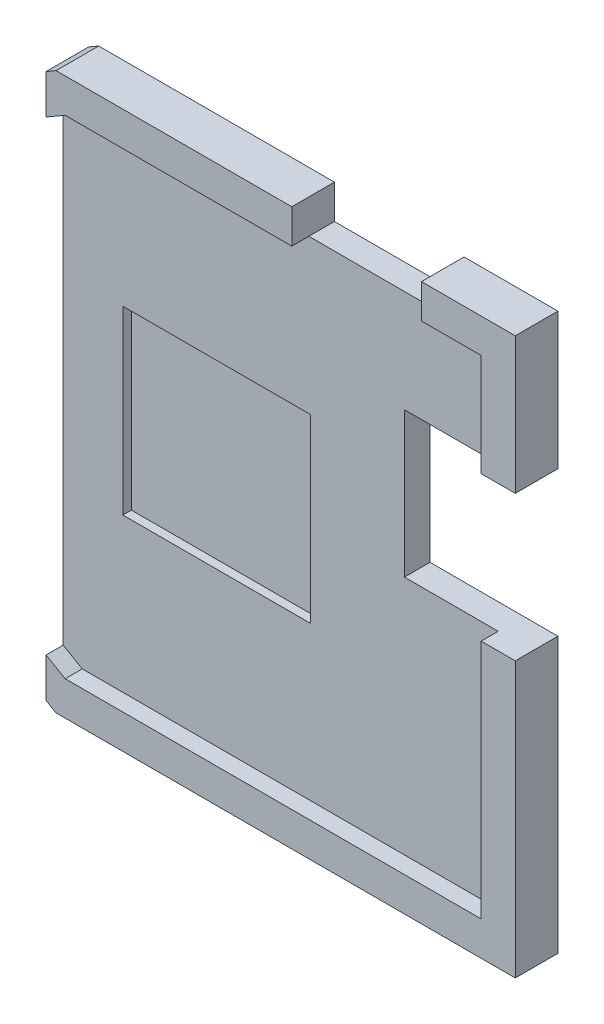
ISO-10303-21;
HEADER;
FILE_DESCRIPTION(('STEP AP214'),'2;1');
FILE_NAME('part.step','',(''),(''),'','','');
FILE_SCHEMA(('AUTOMOTIVE_DESIGN { 1 0 10303 214 1 1 1 1 }'));
ENDSEC;
DATA;
#1=APPLICATION_CONTEXT('core data for automotive mechanical design processes');
#2=APPLICATION_PROTOCOL_DEFINITION('international standard','automotive_design',2000,#1);
#3=PRODUCT_CONTEXT('',#1,'mechanical');
#4=PRODUCT('Part','Part','',(#3));
#5=PRODUCT_RELATED_PRODUCT_CATEGORY('part','',(#4));
#6=PRODUCT_DEFINITION_FORMATION('','',#4);
#7=PRODUCT_DEFINITION_CONTEXT('part definition',#1,'design');
#8=PRODUCT_DEFINITION('design','',#6,#7);
#9=PRODUCT_DEFINITION_SHAPE('','',#8);
#10=(LENGTH_UNIT() NAMED_UNIT(*) SI_UNIT(.MILLI.,.METRE.));
#11=(NAMED_UNIT(*) PLANE_ANGLE_UNIT() SI_UNIT($,.RADIAN.));
#12=(NAMED_UNIT(*) SI_UNIT($,.STERADIAN.) SOLID_ANGLE_UNIT());
#13=UNCERTAINTY_MEASURE_WITH_UNIT(LENGTH_MEASURE(1.E-05),#10,'distance_accuracy_value','');
#14=(GEOMETRIC_REPRESENTATION_CONTEXT(3) GLOBAL_UNCERTAINTY_ASSIGNED_CONTEXT((#13)) GLOBAL_UNIT_ASSIGNED_CONTEXT((#10,
#11,#12)) REPRESENTATION_CONTEXT('',''));
#15=CARTESIAN_POINT('',(0.,0.,0.));
#16=DIRECTION('',(0.,0.,1.));
#17=DIRECTION('',(1.,0.,0.));
#18=AXIS2_PLACEMENT_3D('',#15,#16,#17);
#19=CARTESIAN_POINT('',(30.25,31.4,-8.));
#20=DIRECTION('',(-1.,0.,0.));
#21=DIRECTION('',(0.,0.,1.));
#22=AXIS2_PLACEMENT_3D('',#19,#20,#21);
#23=PLANE('',#22);
#24=DIRECTION('',(0.,1.,0.));
#25=VECTOR('',#24,1.);
#26=CARTESIAN_POINT('',(30.25,0.,16.5));
#27=LINE('',#26,#25);
#28=CARTESIAN_POINT('',(30.25,-15.9637349430953,16.5));
#29=VERTEX_POINT('',#28);
#30=CARTESIAN_POINT('',(30.25,15.9637349430924,16.5));
#31=VERTEX_POINT('',#30);
#32=EDGE_CURVE('E366',#29,#31,#27,.T.);
#33=ORIENTED_EDGE('',*,*,#32,.F.);
#34=DIRECTION('',(0.,0.,1.));
#35=VECTOR('',#34,1.);
#36=CARTESIAN_POINT('',(30.25,-15.9637349430953,16.5));
#37=LINE('',#36,#35);
#38=CARTESIAN_POINT('',(30.25,-15.9637349430953,19.));
#39=VERTEX_POINT('',#38);
#40=EDGE_CURVE('E236',#29,#39,#37,.T.);
#41=ORIENTED_EDGE('',*,*,#40,.T.);
#42=DIRECTION('',(0.,1.,0.));
#43=VECTOR('',#42,1.);
#44=CARTESIAN_POINT('',(30.25,0.,19.));
#45=LINE('',#44,#43);
#46=CARTESIAN_POINT('',(30.25,-13.6543338663368,19.));
#47=VERTEX_POINT('',#46);
#48=EDGE_CURVE('E231',#39,#47,#45,.T.);
#49=ORIENTED_EDGE('',*,*,#48,.T.);
#50=DIRECTION('',(0.,0.,1.));
#51=VECTOR('',#50,1.);
#52=CARTESIAN_POINT('',(30.25,-13.6543338663368,16.5));
#53=LINE('',#52,#51);
#54=CARTESIAN_POINT('',(30.25,-13.6543338663368,18.));
#55=VERTEX_POINT('',#54);
#56=EDGE_CURVE('E230',#55,#47,#53,.T.);
#57=ORIENTED_EDGE('',*,*,#56,.F.);
#58=DIRECTION('',(0.,1.,0.));
#59=VECTOR('',#58,1.);
#60=CARTESIAN_POINT('',(30.25,0.,18.));
#61=LINE('',#60,#59);
#62=CARTESIAN_POINT('',(30.25,13.6543338663339,18.));
#63=VERTEX_POINT('',#62);
#64=EDGE_CURVE('E214',#55,#63,#61,.T.);
#65=ORIENTED_EDGE('',*,*,#64,.T.);
#66=DIRECTION('',(0.,0.,-1.));
#67=VECTOR('',#66,1.);
#68=CARTESIAN_POINT('',(30.25,13.6543338663339,16.5));
#69=LINE('',#68,#67);
#70=CARTESIAN_POINT('',(30.25,13.6543338663339,19.));
#71=VERTEX_POINT('',#70);
#72=EDGE_CURVE('E224',#71,#63,#69,.T.);
#73=ORIENTED_EDGE('',*,*,#72,.F.);
#74=CARTESIAN_POINT('',(30.25,15.9637349430924,19.));
#75=VERTEX_POINT('',#74);
#76=EDGE_CURVE('E371',#71,#75,#45,.T.);
#77=ORIENTED_EDGE('',*,*,#76,.T.);
#78=DIRECTION('',(0.,0.,-1.));
#79=VECTOR('',#78,1.);
#80=CARTESIAN_POINT('',(30.25,15.9637349430924,16.5));
#81=LINE('',#80,#79);
#82=EDGE_CURVE('E239',#75,#31,#81,.T.);
#83=ORIENTED_EDGE('',*,*,#82,.T.);
#84=EDGE_LOOP('',(#33,#41,#49,#57,#65,#73,#77,#83));
#85=FACE_BOUND('',#84,.T.);
#86=ADVANCED_FACE('F33',(#85),#23,.T.);
#87=CARTESIAN_POINT('',(0.,0.,19.));
#88=DIRECTION('',(0.,0.,-1.));
#89=DIRECTION('',(-1.,0.,0.));
#90=AXIS2_PLACEMENT_3D('',#87,#88,#89);
#91=PLANE('',#90);
#92=ORIENTED_EDGE('',*,*,#48,.F.);
#93=DIRECTION('',(-0.866025403784439,0.5,0.));
#94=VECTOR('',#93,1.);
#95=CARTESIAN_POINT('',(30.832428163369,-16.3,19.));
#96=LINE('',#95,#94);
#97=CARTESIAN_POINT('',(30.832428163369,-16.3,19.));
#98=VERTEX_POINT('',#97);
#99=EDGE_CURVE('E249',#98,#39,#96,.T.);
#100=ORIENTED_EDGE('',*,*,#99,.F.);
#101=DIRECTION('',(-1.,0.,0.));
#102=VECTOR('',#101,1.);
#103=CARTESIAN_POINT('',(57.75,-16.3,19.));
#104=LINE('',#103,#102);
#105=CARTESIAN_POINT('',(57.75,-16.3,19.));
#106=VERTEX_POINT('',#105);
#107=EDGE_CURVE('E252',#106,#98,#104,.T.);
#108=ORIENTED_EDGE('',*,*,#107,.F.);
#109=DIRECTION('',(0.,-1.,0.));
#110=VECTOR('',#109,1.);
#111=CARTESIAN_POINT('',(57.75,16.3,19.));
#112=LINE('',#111,#110);
#113=CARTESIAN_POINT('',(57.75,-0.200000000000002,19.));
#114=VERTEX_POINT('',#113);
#115=EDGE_CURVE('E451',#114,#106,#112,.T.);
#116=ORIENTED_EDGE('',*,*,#115,.F.);
#117=DIRECTION('',(1.,0.,0.));
#118=VECTOR('',#117,1.);
#119=CARTESIAN_POINT('',(56.95,-0.200000000000003,19.));
#120=LINE('',#119,#118);
#121=CARTESIAN_POINT('',(55.75,-0.200000000000003,19.));
#122=VERTEX_POINT('',#121);
#123=EDGE_CURVE('E363',#122,#114,#120,.T.);
#124=ORIENTED_EDGE('',*,*,#123,.F.);
#125=DIRECTION('',(0.,-1.,0.));
#126=VECTOR('',#125,1.);
#127=CARTESIAN_POINT('',(55.75,14.3,19.));
#128=LINE('',#127,#126);
#129=CARTESIAN_POINT('',(55.75,-14.3,19.));
#130=VERTEX_POINT('',#129);
#131=EDGE_CURVE('E406',#122,#130,#128,.T.);
#132=ORIENTED_EDGE('',*,*,#131,.T.);
#133=DIRECTION('',(-1.,0.,0.));
#134=VECTOR('',#133,1.);
#135=CARTESIAN_POINT('',(55.75,-14.3,19.));
#136=LINE('',#135,#134);
#137=CARTESIAN_POINT('',(31.3683265482312,-14.3,19.));
#138=VERTEX_POINT('',#137);
#139=EDGE_CURVE('E260',#130,#138,#136,.T.);
#140=ORIENTED_EDGE('',*,*,#139,.T.);
#141=DIRECTION('',(-0.866025403784439,0.5,0.));
#142=VECTOR('',#141,1.);
#143=CARTESIAN_POINT('',(31.3683265482312,-14.3,19.));
#144=LINE('',#143,#142);
#145=EDGE_CURVE('E257',#138,#47,#144,.T.);
#146=ORIENTED_EDGE('',*,*,#145,.T.);
#147=EDGE_LOOP('',(#92,#100,#108,#116,#124,#132,#140,#146));
#148=FACE_BOUND('',#147,.T.);
#149=ADVANCED_FACE('F395',(#148),#91,.F.);
#150=ORIENTED_EDGE('',*,*,#76,.F.);
#151=DIRECTION('',(0.866025403784439,0.5,0.));
#152=VECTOR('',#151,1.);
#153=CARTESIAN_POINT('',(29.25,13.0769835971443,19.));
#154=LINE('',#153,#152);
#155=CARTESIAN_POINT('',(31.3683265482362,14.3,19.));
#156=VERTEX_POINT('',#155);
#157=EDGE_CURVE('E226',#71,#156,#154,.T.);
#158=ORIENTED_EDGE('',*,*,#157,.T.);
#159=DIRECTION('',(1.,0.,0.));
#160=VECTOR('',#159,1.);
#161=CARTESIAN_POINT('',(31.3683265482362,14.3,19.));
#162=LINE('',#161,#160);
#163=CARTESIAN_POINT('',(44.65,14.3,19.));
#164=VERTEX_POINT('',#163);
#165=EDGE_CURVE('E277',#156,#164,#162,.T.);
#166=ORIENTED_EDGE('',*,*,#165,.T.);
#167=DIRECTION('',(0.,1.,0.));
#168=VECTOR('',#167,1.);
#169=CARTESIAN_POINT('',(44.65,0.,19.));
#170=LINE('',#169,#168);
#171=CARTESIAN_POINT('',(44.65,16.3,19.));
#172=VERTEX_POINT('',#171);
#173=EDGE_CURVE('E319',#164,#172,#170,.T.);
#174=ORIENTED_EDGE('',*,*,#173,.T.);
#175=DIRECTION('',(1.,0.,0.));
#176=VECTOR('',#175,1.);
#177=CARTESIAN_POINT('',(30.832428163374,16.3,19.));
#178=LINE('',#177,#176);
#179=CARTESIAN_POINT('',(30.832428163374,16.3,19.));
#180=VERTEX_POINT('',#179);
#181=EDGE_CURVE('E453',#180,#172,#178,.T.);
#182=ORIENTED_EDGE('',*,*,#181,.F.);
#183=DIRECTION('',(0.866025403784439,0.5,0.));
#184=VECTOR('',#183,1.);
#185=CARTESIAN_POINT('',(27.25,14.2316841355235,19.));
#186=LINE('',#185,#184);
#187=EDGE_CURVE('E253',#75,#180,#186,.T.);
#188=ORIENTED_EDGE('',*,*,#187,.F.);
#189=EDGE_LOOP('',(#150,#158,#166,#174,#182,#188));
#190=FACE_BOUND('',#189,.T.);
#191=ADVANCED_FACE('F484',(#190),#91,.F.);
#192=CARTESIAN_POINT('',(29.25,13.0769835971443,16.5));
#193=DIRECTION('',(0.5,-0.866025403784439,0.));
#194=DIRECTION('',(0.866025403784439,0.5,0.));
#195=AXIS2_PLACEMENT_3D('',#192,#193,#194);
#196=PLANE('',#195);
#197=ORIENTED_EDGE('',*,*,#157,.F.);
#198=ORIENTED_EDGE('',*,*,#72,.T.);
#199=DIRECTION('',(0.866025403784439,0.5,0.));
#200=VECTOR('',#199,1.);
#201=CARTESIAN_POINT('',(29.25,13.0769835971443,18.));
#202=LINE('',#201,#200);
#203=CARTESIAN_POINT('',(31.3683265482362,14.3,18.));
#204=VERTEX_POINT('',#203);
#205=EDGE_CURVE('E37',#63,#204,#202,.T.);
#206=ORIENTED_EDGE('',*,*,#205,.T.);
#207=DIRECTION('',(0.,0.,1.));
#208=VECTOR('',#207,1.);
#209=CARTESIAN_POINT('',(31.3683265482362,14.3,16.5));
#210=LINE('',#209,#208);
#211=EDGE_CURVE('E255',#204,#156,#210,.T.);
#212=ORIENTED_EDGE('',*,*,#211,.T.);
#213=EDGE_LOOP('',(#197,#198,#206,#212));
#214=FACE_BOUND('',#213,.T.);
#215=ADVANCED_FACE('F225',(#214),#196,.T.);
#216=CARTESIAN_POINT('',(31.3683265482312,-14.3,16.5));
#217=DIRECTION('',(0.5,0.866025403784438,0.));
#218=DIRECTION('',(-0.866025403784439,0.5,0.));
#219=AXIS2_PLACEMENT_3D('',#216,#217,#218);
#220=PLANE('',#219);
#221=DIRECTION('',(-0.866025403784439,0.5,0.));
#222=VECTOR('',#221,1.);
#223=CARTESIAN_POINT('',(31.3683265482312,-14.3,18.));
#224=LINE('',#223,#222);
#225=CARTESIAN_POINT('',(31.3683265482312,-14.3,18.));
#226=VERTEX_POINT('',#225);
#227=EDGE_CURVE('E262',#226,#55,#224,.T.);
#228=ORIENTED_EDGE('',*,*,#227,.T.);
#229=ORIENTED_EDGE('',*,*,#56,.T.);
#230=ORIENTED_EDGE('',*,*,#145,.F.);
#231=DIRECTION('',(0.,0.,1.));
#232=VECTOR('',#231,1.);
#233=CARTESIAN_POINT('',(31.3683265482312,-14.3,16.5));
#234=LINE('',#233,#232);
#235=EDGE_CURVE('E261',#226,#138,#234,.T.);
#236=ORIENTED_EDGE('',*,*,#235,.F.);
#237=EDGE_LOOP('',(#228,#229,#230,#236));
#238=FACE_BOUND('',#237,.T.);
#239=ADVANCED_FACE('F35',(#238),#220,.T.);
#240=CARTESIAN_POINT('',(0.,0.,16.5));
#241=DIRECTION('',(0.,0.,-1.));
#242=DIRECTION('',(-1.,0.,0.));
#243=AXIS2_PLACEMENT_3D('',#240,#241,#242);
#244=PLANE('',#243);
#245=DIRECTION('',(-0.866025403784439,0.5,0.));
#246=VECTOR('',#245,1.);
#247=CARTESIAN_POINT('',(30.832428163369,-16.3,16.5));
#248=LINE('',#247,#246);
#249=CARTESIAN_POINT('',(30.832428163369,-16.3,16.5));
#250=VERTEX_POINT('',#249);
#251=EDGE_CURVE('E243',#250,#29,#248,.T.);
#252=ORIENTED_EDGE('',*,*,#251,.T.);
#253=ORIENTED_EDGE('',*,*,#32,.T.);
#254=DIRECTION('',(0.866025403784439,0.5,0.));
#255=VECTOR('',#254,1.);
#256=CARTESIAN_POINT('',(27.25,14.2316841355235,16.5));
#257=LINE('',#256,#255);
#258=CARTESIAN_POINT('',(30.832428163374,16.3,16.5));
#259=VERTEX_POINT('',#258);
#260=EDGE_CURVE('E247',#31,#259,#257,.T.);
#261=ORIENTED_EDGE('',*,*,#260,.T.);
#262=DIRECTION('',(1.,0.,0.));
#263=VECTOR('',#262,1.);
#264=CARTESIAN_POINT('',(30.832428163374,16.3,16.5));
#265=LINE('',#264,#263);
#266=CARTESIAN_POINT('',(44.65,16.3,16.5));
#267=VERTEX_POINT('',#266);
#268=EDGE_CURVE('E462',#259,#267,#265,.T.);
#269=ORIENTED_EDGE('',*,*,#268,.T.);
#270=DIRECTION('',(0.,1.,0.));
#271=VECTOR('',#270,1.);
#272=CARTESIAN_POINT('',(44.65,14.3,16.5));
#273=LINE('',#272,#271);
#274=CARTESIAN_POINT('',(44.65,14.3,16.5));
#275=VERTEX_POINT('',#274);
#276=EDGE_CURVE('E322',#275,#267,#273,.T.);
#277=ORIENTED_EDGE('',*,*,#276,.F.);
#278=DIRECTION('',(-1.,0.,0.));
#279=VECTOR('',#278,1.);
#280=CARTESIAN_POINT('',(44.65,14.3,16.5));
#281=LINE('',#280,#279);
#282=CARTESIAN_POINT('',(52.25,14.3,16.5));
#283=VERTEX_POINT('',#282);
#284=EDGE_CURVE('E334',#283,#275,#281,.T.);
#285=ORIENTED_EDGE('',*,*,#284,.F.);
#286=DIRECTION('',(0.,1.,0.));
#287=VECTOR('',#286,1.);
#288=CARTESIAN_POINT('',(52.25,14.3,16.5));
#289=LINE('',#288,#287);
#290=CARTESIAN_POINT('',(52.25,16.3,16.5));
#291=VERTEX_POINT('',#290);
#292=EDGE_CURVE('E323',#283,#291,#289,.T.);
#293=ORIENTED_EDGE('',*,*,#292,.T.);
#294=CARTESIAN_POINT('',(57.75,16.3,16.5));
#295=VERTEX_POINT('',#294);
#296=EDGE_CURVE('E250',#291,#295,#265,.T.);
#297=ORIENTED_EDGE('',*,*,#296,.T.);
#298=DIRECTION('',(0.,-1.,0.));
#299=VECTOR('',#298,1.);
#300=CARTESIAN_POINT('',(57.75,16.3,16.5));
#301=LINE('',#300,#299);
#302=CARTESIAN_POINT('',(57.75,8.3,16.5));
#303=VERTEX_POINT('',#302);
#304=EDGE_CURVE('E442',#295,#303,#301,.T.);
#305=ORIENTED_EDGE('',*,*,#304,.T.);
#306=DIRECTION('',(1.,0.,0.));
#307=VECTOR('',#306,1.);
#308=CARTESIAN_POINT('',(56.95,8.3,16.5));
#309=LINE('',#308,#307);
#310=CARTESIAN_POINT('',(50.25,8.3,16.5));
#311=VERTEX_POINT('',#310);
#312=EDGE_CURVE('E356',#311,#303,#309,.T.);
#313=ORIENTED_EDGE('',*,*,#312,.F.);
#314=DIRECTION('',(0.,1.,0.));
#315=VECTOR('',#314,1.);
#316=CARTESIAN_POINT('',(50.25,-0.200000000000003,16.5));
#317=LINE('',#316,#315);
#318=CARTESIAN_POINT('',(50.25,-0.200000000000003,16.5));
#319=VERTEX_POINT('',#318);
#320=EDGE_CURVE('E358',#319,#311,#317,.T.);
#321=ORIENTED_EDGE('',*,*,#320,.F.);
#322=DIRECTION('',(-1.,0.,0.));
#323=VECTOR('',#322,1.);
#324=CARTESIAN_POINT('',(56.95,-0.200000000000003,16.5));
#325=LINE('',#324,#323);
#326=CARTESIAN_POINT('',(57.75,-0.200000000000002,16.5));
#327=VERTEX_POINT('',#326);
#328=EDGE_CURVE('E347',#327,#319,#325,.T.);
#329=ORIENTED_EDGE('',*,*,#328,.F.);
#330=CARTESIAN_POINT('',(57.75,-16.3,16.5));
#331=VERTEX_POINT('',#330);
#332=EDGE_CURVE('E461',#327,#331,#301,.T.);
#333=ORIENTED_EDGE('',*,*,#332,.T.);
#334=DIRECTION('',(-1.,0.,0.));
#335=VECTOR('',#334,1.);
#336=CARTESIAN_POINT('',(57.75,-16.3,16.5));
#337=LINE('',#336,#335);
#338=EDGE_CURVE('E245',#331,#250,#337,.T.);
#339=ORIENTED_EDGE('',*,*,#338,.T.);
#340=EDGE_LOOP('',(#252,#253,#261,#269,#277,#285,#293,#297,#305,#313,#321,#329,#333,#339));
#341=FACE_BOUND('',#340,.T.);
#342=ADVANCED_FACE('F383',(#341),#244,.T.);
#343=CARTESIAN_POINT('',(27.25,14.2316841355235,16.5));
#344=DIRECTION('',(0.5,-0.866025403784439,0.));
#345=DIRECTION('',(0.866025403784439,0.5,0.));
#346=AXIS2_PLACEMENT_3D('',#343,#344,#345);
#347=PLANE('',#346);
#348=ORIENTED_EDGE('',*,*,#82,.F.);
#349=ORIENTED_EDGE('',*,*,#187,.T.);
#350=DIRECTION('',(0.,0.,1.));
#351=VECTOR('',#350,1.);
#352=CARTESIAN_POINT('',(30.832428163374,16.3,16.5));
#353=LINE('',#352,#351);
#354=EDGE_CURVE('E379',#259,#180,#353,.T.);
#355=ORIENTED_EDGE('',*,*,#354,.F.);
#356=ORIENTED_EDGE('',*,*,#260,.F.);
#357=EDGE_LOOP('',(#348,#349,#355,#356));
#358=FACE_BOUND('',#357,.T.);
#359=ADVANCED_FACE('F376',(#358),#347,.F.);
#360=CARTESIAN_POINT('',(30.832428163369,-16.3,16.5));
#361=DIRECTION('',(0.5,0.866025403784439,0.));
#362=DIRECTION('',(-0.866025403784439,0.5,0.));
#363=AXIS2_PLACEMENT_3D('',#360,#361,#362);
#364=PLANE('',#363);
#365=ORIENTED_EDGE('',*,*,#40,.F.);
#366=ORIENTED_EDGE('',*,*,#251,.F.);
#367=DIRECTION('',(0.,0.,1.));
#368=VECTOR('',#367,1.);
#369=CARTESIAN_POINT('',(30.832428163369,-16.3,16.5));
#370=LINE('',#369,#368);
#371=EDGE_CURVE('E246',#250,#98,#370,.T.);
#372=ORIENTED_EDGE('',*,*,#371,.T.);
#373=ORIENTED_EDGE('',*,*,#99,.T.);
#374=EDGE_LOOP('',(#365,#366,#372,#373));
#375=FACE_BOUND('',#374,.T.);
#376=ADVANCED_FACE('F388',(#375),#364,.F.);
#377=CARTESIAN_POINT('',(0.,0.,18.));
#378=DIRECTION('',(0.,0.,-1.));
#379=DIRECTION('',(-1.,0.,0.));
#380=AXIS2_PLACEMENT_3D('',#377,#378,#379);
#381=PLANE('',#380);
#382=DIRECTION('',(1.,0.,0.));
#383=VECTOR('',#382,1.);
#384=CARTESIAN_POINT('',(44.75,5.3,18.));
#385=LINE('',#384,#383);
#386=CARTESIAN_POINT('',(33.75,5.3,18.));
#387=VERTEX_POINT('',#386);
#388=CARTESIAN_POINT('',(44.75,5.3,18.));
#389=VERTEX_POINT('',#388);
#390=EDGE_CURVE('E285',#387,#389,#385,.T.);
#391=ORIENTED_EDGE('',*,*,#390,.T.);
#392=DIRECTION('',(0.,-1.,0.));
#393=VECTOR('',#392,1.);
#394=CARTESIAN_POINT('',(44.75,5.3,18.));
#395=LINE('',#394,#393);
#396=CARTESIAN_POINT('',(44.75,-5.3,18.));
#397=VERTEX_POINT('',#396);
#398=EDGE_CURVE('E301',#389,#397,#395,.T.);
#399=ORIENTED_EDGE('',*,*,#398,.T.);
#400=DIRECTION('',(-1.,0.,0.));
#401=VECTOR('',#400,1.);
#402=CARTESIAN_POINT('',(44.75,-5.3,18.));
#403=LINE('',#402,#401);
#404=CARTESIAN_POINT('',(33.75,-5.3,18.));
#405=VERTEX_POINT('',#404);
#406=EDGE_CURVE('E298',#397,#405,#403,.T.);
#407=ORIENTED_EDGE('',*,*,#406,.T.);
#408=DIRECTION('',(0.,1.,0.));
#409=VECTOR('',#408,1.);
#410=CARTESIAN_POINT('',(33.75,5.3,18.));
#411=LINE('',#410,#409);
#412=EDGE_CURVE('E295',#405,#387,#411,.T.);
#413=ORIENTED_EDGE('',*,*,#412,.T.);
#414=EDGE_LOOP('',(#391,#399,#407,#413));
#415=FACE_BOUND('',#414,.T.);
#416=ORIENTED_EDGE('',*,*,#64,.F.);
#417=ORIENTED_EDGE('',*,*,#227,.F.);
#418=DIRECTION('',(-1.,0.,0.));
#419=VECTOR('',#418,1.);
#420=CARTESIAN_POINT('',(55.75,-14.3,18.));
#421=LINE('',#420,#419);
#422=CARTESIAN_POINT('',(55.75,-14.3,18.));
#423=VERTEX_POINT('',#422);
#424=EDGE_CURVE('E264',#423,#226,#421,.T.);
#425=ORIENTED_EDGE('',*,*,#424,.F.);
#426=DIRECTION('',(0.,-1.,0.));
#427=VECTOR('',#426,1.);
#428=CARTESIAN_POINT('',(55.75,14.3,18.));
#429=LINE('',#428,#427);
#430=CARTESIAN_POINT('',(55.75,-0.200000000000003,18.));
#431=VERTEX_POINT('',#430);
#432=EDGE_CURVE('E274',#431,#423,#429,.T.);
#433=ORIENTED_EDGE('',*,*,#432,.F.);
#434=DIRECTION('',(1.,0.,0.));
#435=VECTOR('',#434,1.);
#436=CARTESIAN_POINT('',(56.95,-0.200000000000003,18.));
#437=LINE('',#436,#435);
#438=CARTESIAN_POINT('',(50.25,-0.200000000000003,18.));
#439=VERTEX_POINT('',#438);
#440=EDGE_CURVE('E42',#439,#431,#437,.T.);
#441=ORIENTED_EDGE('',*,*,#440,.F.);
#442=DIRECTION('',(0.,-1.,0.));
#443=VECTOR('',#442,1.);
#444=CARTESIAN_POINT('',(50.25,-0.200000000000003,18.));
#445=LINE('',#444,#443);
#446=CARTESIAN_POINT('',(50.25,8.3,18.));
#447=VERTEX_POINT('',#446);
#448=EDGE_CURVE('E11',#447,#439,#445,.T.);
#449=ORIENTED_EDGE('',*,*,#448,.F.);
#450=DIRECTION('',(-1.,0.,0.));
#451=VECTOR('',#450,1.);
#452=CARTESIAN_POINT('',(56.95,8.3,18.));
#453=LINE('',#452,#451);
#454=CARTESIAN_POINT('',(55.75,8.3,18.));
#455=VERTEX_POINT('',#454);
#456=EDGE_CURVE('E343',#455,#447,#453,.T.);
#457=ORIENTED_EDGE('',*,*,#456,.F.);
#458=CARTESIAN_POINT('',(55.75,14.3,18.));
#459=VERTEX_POINT('',#458);
#460=EDGE_CURVE('E268',#459,#455,#429,.T.);
#461=ORIENTED_EDGE('',*,*,#460,.F.);
#462=DIRECTION('',(1.,0.,0.));
#463=VECTOR('',#462,1.);
#464=CARTESIAN_POINT('',(31.3683265482362,14.3,18.));
#465=LINE('',#464,#463);
#466=CARTESIAN_POINT('',(52.25,14.3,18.));
#467=VERTEX_POINT('',#466);
#468=EDGE_CURVE('E222',#467,#459,#465,.T.);
#469=ORIENTED_EDGE('',*,*,#468,.F.);
#470=CARTESIAN_POINT('',(44.65,14.3,18.));
#471=VERTEX_POINT('',#470);
#472=EDGE_CURVE('E281',#471,#467,#465,.T.);
#473=ORIENTED_EDGE('',*,*,#472,.F.);
#474=EDGE_CURVE('E217',#204,#471,#465,.T.);
#475=ORIENTED_EDGE('',*,*,#474,.F.);
#476=ORIENTED_EDGE('',*,*,#205,.F.);
#477=EDGE_LOOP('',(#416,#417,#425,#433,#441,#449,#457,#461,#469,#473,#475,#476));
#478=FACE_BOUND('',#477,.T.);
#479=ADVANCED_FACE('F212',(#415,#478),#381,.F.);
#480=CARTESIAN_POINT('',(55.75,14.3,16.5));
#481=DIRECTION('',(-1.,0.,0.));
#482=DIRECTION('',(0.,0.,1.));
#483=AXIS2_PLACEMENT_3D('',#480,#481,#482);
#484=PLANE('',#483);
#485=DIRECTION('',(0.,0.,-1.));
#486=VECTOR('',#485,1.);
#487=CARTESIAN_POINT('',(55.75,-0.200000000000003,26.001));
#488=LINE('',#487,#486);
#489=EDGE_CURVE('E360',#122,#431,#488,.T.);
#490=ORIENTED_EDGE('',*,*,#489,.T.);
#491=ORIENTED_EDGE('',*,*,#432,.T.);
#492=DIRECTION('',(0.,0.,1.));
#493=VECTOR('',#492,1.);
#494=CARTESIAN_POINT('',(55.75,-14.3,16.5));
#495=LINE('',#494,#493);
#496=EDGE_CURVE('E397',#423,#130,#495,.T.);
#497=ORIENTED_EDGE('',*,*,#496,.T.);
#498=ORIENTED_EDGE('',*,*,#131,.F.);
#499=EDGE_LOOP('',(#490,#491,#497,#498));
#500=FACE_BOUND('',#499,.T.);
#501=ADVANCED_FACE('F506',(#500),#484,.T.);
#502=CARTESIAN_POINT('',(57.75,16.3,16.5));
#503=DIRECTION('',(-1.,0.,0.));
#504=DIRECTION('',(0.,-1.,0.));
#505=AXIS2_PLACEMENT_3D('',#502,#503,#504);
#506=PLANE('',#505);
#507=ORIENTED_EDGE('',*,*,#332,.F.);
#508=DIRECTION('',(0.,0.,-1.));
#509=VECTOR('',#508,1.);
#510=CARTESIAN_POINT('',(57.75,-0.200000000000002,26.001));
#511=LINE('',#510,#509);
#512=EDGE_CURVE('E351',#114,#327,#511,.T.);
#513=ORIENTED_EDGE('',*,*,#512,.F.);
#514=ORIENTED_EDGE('',*,*,#115,.T.);
#515=DIRECTION('',(0.,0.,1.));
#516=VECTOR('',#515,1.);
#517=CARTESIAN_POINT('',(57.75,-16.3,16.5));
#518=LINE('',#517,#516);
#519=EDGE_CURVE('E577',#331,#106,#518,.T.);
#520=ORIENTED_EDGE('',*,*,#519,.F.);
#521=EDGE_LOOP('',(#507,#513,#514,#520));
#522=FACE_BOUND('',#521,.T.);
#523=ADVANCED_FACE('F559',(#522),#506,.F.);
#524=CARTESIAN_POINT('',(31.3683265482362,14.3,16.5));
#525=DIRECTION('',(0.,-1.,0.));
#526=DIRECTION('',(0.,0.,-1.));
#527=AXIS2_PLACEMENT_3D('',#524,#525,#526);
#528=PLANE('',#527);
#529=DIRECTION('',(0.,0.,-1.));
#530=VECTOR('',#529,1.);
#531=CARTESIAN_POINT('',(52.25,14.3,17.2));
#532=LINE('',#531,#530);
#533=CARTESIAN_POINT('',(52.25,14.3,19.));
#534=VERTEX_POINT('',#533);
#535=EDGE_CURVE('E337',#534,#467,#532,.T.);
#536=ORIENTED_EDGE('',*,*,#535,.T.);
#537=ORIENTED_EDGE('',*,*,#468,.T.);
#538=DIRECTION('',(0.,0.,1.));
#539=VECTOR('',#538,1.);
#540=CARTESIAN_POINT('',(55.75,14.3,16.5));
#541=LINE('',#540,#539);
#542=CARTESIAN_POINT('',(55.75,14.3,19.));
#543=VERTEX_POINT('',#542);
#544=EDGE_CURVE('E400',#459,#543,#541,.T.);
#545=ORIENTED_EDGE('',*,*,#544,.T.);
#546=EDGE_CURVE('E263',#534,#543,#162,.T.);
#547=ORIENTED_EDGE('',*,*,#546,.F.);
#548=EDGE_LOOP('',(#536,#537,#545,#547));
#549=FACE_BOUND('',#548,.T.);
#550=ADVANCED_FACE('F422',(#549),#528,.T.);
#551=CARTESIAN_POINT('',(30.832428163374,16.3,16.5));
#552=DIRECTION('',(0.,-1.,0.));
#553=DIRECTION('',(1.,0.,0.));
#554=AXIS2_PLACEMENT_3D('',#551,#552,#553);
#555=PLANE('',#554);
#556=ORIENTED_EDGE('',*,*,#296,.F.);
#557=DIRECTION('',(0.,0.,1.));
#558=VECTOR('',#557,1.);
#559=CARTESIAN_POINT('',(52.25,16.3,16.5));
#560=LINE('',#559,#558);
#561=CARTESIAN_POINT('',(52.25,16.3,19.));
#562=VERTEX_POINT('',#561);
#563=EDGE_CURVE('E369',#291,#562,#560,.T.);
#564=ORIENTED_EDGE('',*,*,#563,.T.);
#565=CARTESIAN_POINT('',(57.75,16.3,19.));
#566=VERTEX_POINT('',#565);
#567=EDGE_CURVE('E256',#562,#566,#178,.T.);
#568=ORIENTED_EDGE('',*,*,#567,.T.);
#569=DIRECTION('',(0.,0.,1.));
#570=VECTOR('',#569,1.);
#571=CARTESIAN_POINT('',(57.75,16.3,16.5));
#572=LINE('',#571,#570);
#573=EDGE_CURVE('E450',#295,#566,#572,.T.);
#574=ORIENTED_EDGE('',*,*,#573,.F.);
#575=EDGE_LOOP('',(#556,#564,#568,#574));
#576=FACE_BOUND('',#575,.T.);
#577=ADVANCED_FACE('F500',(#576),#555,.F.);
#578=CARTESIAN_POINT('',(44.75,-5.3,18.));
#579=DIRECTION('',(0.,-1.,0.));
#580=DIRECTION('',(0.,0.,-1.));
#581=AXIS2_PLACEMENT_3D('',#578,#579,#580);
#582=PLANE('',#581);
#583=DIRECTION('',(1.,0.,0.));
#584=VECTOR('',#583,1.);
#585=CARTESIAN_POINT('',(44.75,-5.3,17.5));
#586=LINE('',#585,#584);
#587=CARTESIAN_POINT('',(33.75,-5.3,17.5));
#588=VERTEX_POINT('',#587);
#589=CARTESIAN_POINT('',(44.75,-5.3,17.5));
#590=VERTEX_POINT('',#589);
#591=EDGE_CURVE('E304',#588,#590,#586,.T.);
#592=ORIENTED_EDGE('',*,*,#591,.F.);
#593=DIRECTION('',(0.,0.,-1.));
#594=VECTOR('',#593,1.);
#595=CARTESIAN_POINT('',(33.75,-5.3,18.));
#596=LINE('',#595,#594);
#597=EDGE_CURVE('E286',#405,#588,#596,.T.);
#598=ORIENTED_EDGE('',*,*,#597,.F.);
#599=ORIENTED_EDGE('',*,*,#406,.F.);
#600=DIRECTION('',(0.,0.,-1.));
#601=VECTOR('',#600,1.);
#602=CARTESIAN_POINT('',(44.75,-5.3,18.));
#603=LINE('',#602,#601);
#604=EDGE_CURVE('E282',#397,#590,#603,.T.);
#605=ORIENTED_EDGE('',*,*,#604,.T.);
#606=EDGE_LOOP('',(#592,#598,#599,#605));
#607=FACE_BOUND('',#606,.T.);
#608=ADVANCED_FACE('F514',(#607),#582,.F.);
#609=CARTESIAN_POINT('',(33.75,5.3,18.));
#610=DIRECTION('',(-1.,0.,0.));
#611=DIRECTION('',(0.,0.,1.));
#612=AXIS2_PLACEMENT_3D('',#609,#610,#611);
#613=PLANE('',#612);
#614=DIRECTION('',(0.,-1.,0.));
#615=VECTOR('',#614,1.);
#616=CARTESIAN_POINT('',(33.75,5.3,17.5));
#617=LINE('',#616,#615);
#618=CARTESIAN_POINT('',(33.75,5.3,17.5));
#619=VERTEX_POINT('',#618);
#620=EDGE_CURVE('E307',#619,#588,#617,.T.);
#621=ORIENTED_EDGE('',*,*,#620,.F.);
#622=DIRECTION('',(0.,0.,-1.));
#623=VECTOR('',#622,1.);
#624=CARTESIAN_POINT('',(33.75,5.3,18.));
#625=LINE('',#624,#623);
#626=EDGE_CURVE('E289',#387,#619,#625,.T.);
#627=ORIENTED_EDGE('',*,*,#626,.F.);
#628=ORIENTED_EDGE('',*,*,#412,.F.);
#629=ORIENTED_EDGE('',*,*,#597,.T.);
#630=EDGE_LOOP('',(#621,#627,#628,#629));
#631=FACE_BOUND('',#630,.T.);
#632=ADVANCED_FACE('F517',(#631),#613,.F.);
#633=CARTESIAN_POINT('',(44.75,5.3,18.));
#634=DIRECTION('',(0.,1.,0.));
#635=DIRECTION('',(0.,0.,1.));
#636=AXIS2_PLACEMENT_3D('',#633,#634,#635);
#637=PLANE('',#636);
#638=DIRECTION('',(-1.,0.,0.));
#639=VECTOR('',#638,1.);
#640=CARTESIAN_POINT('',(44.75,5.3,17.5));
#641=LINE('',#640,#639);
#642=CARTESIAN_POINT('',(44.75,5.3,17.5));
#643=VERTEX_POINT('',#642);
#644=EDGE_CURVE('E310',#643,#619,#641,.T.);
#645=ORIENTED_EDGE('',*,*,#644,.F.);
#646=DIRECTION('',(0.,0.,-1.));
#647=VECTOR('',#646,1.);
#648=CARTESIAN_POINT('',(44.75,5.3,18.));
#649=LINE('',#648,#647);
#650=EDGE_CURVE('E221',#389,#643,#649,.T.);
#651=ORIENTED_EDGE('',*,*,#650,.F.);
#652=ORIENTED_EDGE('',*,*,#390,.F.);
#653=ORIENTED_EDGE('',*,*,#626,.T.);
#654=EDGE_LOOP('',(#645,#651,#652,#653));
#655=FACE_BOUND('',#654,.T.);
#656=ADVANCED_FACE('F512',(#655),#637,.F.);
#657=CARTESIAN_POINT('',(44.75,5.3,18.));
#658=DIRECTION('',(1.,0.,0.));
#659=DIRECTION('',(0.,0.,-1.));
#660=AXIS2_PLACEMENT_3D('',#657,#658,#659);
#661=PLANE('',#660);
#662=DIRECTION('',(0.,1.,0.));
#663=VECTOR('',#662,1.);
#664=CARTESIAN_POINT('',(44.75,5.3,17.5));
#665=LINE('',#664,#663);
#666=EDGE_CURVE('E313',#590,#643,#665,.T.);
#667=ORIENTED_EDGE('',*,*,#666,.F.);
#668=ORIENTED_EDGE('',*,*,#604,.F.);
#669=ORIENTED_EDGE('',*,*,#398,.F.);
#670=ORIENTED_EDGE('',*,*,#650,.T.);
#671=EDGE_LOOP('',(#667,#668,#669,#670));
#672=FACE_BOUND('',#671,.T.);
#673=ADVANCED_FACE('F509',(#672),#661,.F.);
#674=DIRECTION('',(0.,0.,1.));
#675=VECTOR('',#674,1.);
#676=CARTESIAN_POINT('',(44.65,14.3,17.2));
#677=LINE('',#676,#675);
#678=EDGE_CURVE('E333',#471,#164,#677,.T.);
#679=ORIENTED_EDGE('',*,*,#678,.T.);
#680=ORIENTED_EDGE('',*,*,#165,.F.);
#681=ORIENTED_EDGE('',*,*,#211,.F.);
#682=ORIENTED_EDGE('',*,*,#474,.T.);
#683=EDGE_LOOP('',(#679,#680,#681,#682));
#684=FACE_BOUND('',#683,.T.);
#685=ADVANCED_FACE('F466',(#684),#528,.T.);
#686=DIRECTION('',(0.,0.,1.));
#687=VECTOR('',#686,1.);
#688=CARTESIAN_POINT('',(55.75,8.3,26.001));
#689=LINE('',#688,#687);
#690=CARTESIAN_POINT('',(55.75,8.3,19.));
#691=VERTEX_POINT('',#690);
#692=EDGE_CURVE('E340',#455,#691,#689,.T.);
#693=ORIENTED_EDGE('',*,*,#692,.T.);
#694=EDGE_CURVE('E404',#543,#691,#128,.T.);
#695=ORIENTED_EDGE('',*,*,#694,.F.);
#696=ORIENTED_EDGE('',*,*,#544,.F.);
#697=ORIENTED_EDGE('',*,*,#460,.T.);
#698=EDGE_LOOP('',(#693,#695,#696,#697));
#699=FACE_BOUND('',#698,.T.);
#700=ADVANCED_FACE('F426',(#699),#484,.T.);
#701=CARTESIAN_POINT('',(55.75,-14.3,16.5));
#702=DIRECTION('',(0.,1.,0.));
#703=DIRECTION('',(-1.,0.,0.));
#704=AXIS2_PLACEMENT_3D('',#701,#702,#703);
#705=PLANE('',#704);
#706=ORIENTED_EDGE('',*,*,#496,.F.);
#707=ORIENTED_EDGE('',*,*,#424,.T.);
#708=ORIENTED_EDGE('',*,*,#235,.T.);
#709=ORIENTED_EDGE('',*,*,#139,.F.);
#710=EDGE_LOOP('',(#706,#707,#708,#709));
#711=FACE_BOUND('',#710,.T.);
#712=ADVANCED_FACE('F494',(#711),#705,.T.);
#713=ORIENTED_EDGE('',*,*,#694,.T.);
#714=DIRECTION('',(-1.,0.,0.));
#715=VECTOR('',#714,1.);
#716=CARTESIAN_POINT('',(56.95,8.3,19.));
#717=LINE('',#716,#715);
#718=CARTESIAN_POINT('',(57.75,8.3,19.));
#719=VERTEX_POINT('',#718);
#720=EDGE_CURVE('E330',#719,#691,#717,.T.);
#721=ORIENTED_EDGE('',*,*,#720,.F.);
#722=EDGE_CURVE('E448',#566,#719,#112,.T.);
#723=ORIENTED_EDGE('',*,*,#722,.F.);
#724=ORIENTED_EDGE('',*,*,#567,.F.);
#725=DIRECTION('',(0.,-1.,0.));
#726=VECTOR('',#725,1.);
#727=CARTESIAN_POINT('',(52.25,0.,19.));
#728=LINE('',#727,#726);
#729=EDGE_CURVE('E316',#562,#534,#728,.T.);
#730=ORIENTED_EDGE('',*,*,#729,.T.);
#731=ORIENTED_EDGE('',*,*,#546,.T.);
#732=EDGE_LOOP('',(#713,#721,#723,#724,#730,#731));
#733=FACE_BOUND('',#732,.T.);
#734=ADVANCED_FACE('F417',(#733),#91,.F.);
#735=ORIENTED_EDGE('',*,*,#181,.T.);
#736=DIRECTION('',(0.,0.,1.));
#737=VECTOR('',#736,1.);
#738=CARTESIAN_POINT('',(44.65,16.3,17.2));
#739=LINE('',#738,#737);
#740=EDGE_CURVE('E328',#267,#172,#739,.T.);
#741=ORIENTED_EDGE('',*,*,#740,.F.);
#742=ORIENTED_EDGE('',*,*,#268,.F.);
#743=ORIENTED_EDGE('',*,*,#354,.T.);
#744=EDGE_LOOP('',(#735,#741,#742,#743));
#745=FACE_BOUND('',#744,.T.);
#746=ADVANCED_FACE('F482',(#745),#555,.F.);
#747=ORIENTED_EDGE('',*,*,#722,.T.);
#748=DIRECTION('',(0.,0.,-1.));
#749=VECTOR('',#748,1.);
#750=CARTESIAN_POINT('',(57.75,8.3,26.001));
#751=LINE('',#750,#749);
#752=EDGE_CURVE('E348',#719,#303,#751,.T.);
#753=ORIENTED_EDGE('',*,*,#752,.T.);
#754=ORIENTED_EDGE('',*,*,#304,.F.);
#755=ORIENTED_EDGE('',*,*,#573,.T.);
#756=EDGE_LOOP('',(#747,#753,#754,#755));
#757=FACE_BOUND('',#756,.T.);
#758=ADVANCED_FACE('F445',(#757),#506,.F.);
#759=CARTESIAN_POINT('',(57.75,-16.3,16.5));
#760=DIRECTION('',(0.,1.,0.));
#761=DIRECTION('',(0.,0.,1.));
#762=AXIS2_PLACEMENT_3D('',#759,#760,#761);
#763=PLANE('',#762);
#764=ORIENTED_EDGE('',*,*,#519,.T.);
#765=ORIENTED_EDGE('',*,*,#107,.T.);
#766=ORIENTED_EDGE('',*,*,#371,.F.);
#767=ORIENTED_EDGE('',*,*,#338,.F.);
#768=EDGE_LOOP('',(#764,#765,#766,#767));
#769=FACE_BOUND('',#768,.T.);
#770=ADVANCED_FACE('F543',(#769),#763,.F.);
#771=CARTESIAN_POINT('',(0.,0.,17.5));
#772=DIRECTION('',(0.,0.,-1.));
#773=DIRECTION('',(-1.,0.,0.));
#774=AXIS2_PLACEMENT_3D('',#771,#772,#773);
#775=PLANE('',#774);
#776=ORIENTED_EDGE('',*,*,#620,.T.);
#777=ORIENTED_EDGE('',*,*,#591,.T.);
#778=ORIENTED_EDGE('',*,*,#666,.T.);
#779=ORIENTED_EDGE('',*,*,#644,.T.);
#780=EDGE_LOOP('',(#776,#777,#778,#779));
#781=FACE_BOUND('',#780,.T.);
#782=ADVANCED_FACE('F529',(#781),#775,.F.);
#783=CARTESIAN_POINT('',(52.25,14.3,24.8));
#784=DIRECTION('',(1.,0.,0.));
#785=DIRECTION('',(0.,1.,0.));
#786=AXIS2_PLACEMENT_3D('',#783,#784,#785);
#787=PLANE('',#786);
#788=ORIENTED_EDGE('',*,*,#563,.F.);
#789=ORIENTED_EDGE('',*,*,#292,.F.);
#790=EDGE_CURVE('E331',#467,#283,#532,.T.);
#791=ORIENTED_EDGE('',*,*,#790,.F.);
#792=ORIENTED_EDGE('',*,*,#535,.F.);
#793=ORIENTED_EDGE('',*,*,#729,.F.);
#794=EDGE_LOOP('',(#788,#789,#791,#792,#793));
#795=FACE_BOUND('',#794,.T.);
#796=ADVANCED_FACE('F475',(#795),#787,.F.);
#797=CARTESIAN_POINT('',(44.65,14.3,17.2));
#798=DIRECTION('',(-1.,0.,0.));
#799=DIRECTION('',(0.,-1.,0.));
#800=AXIS2_PLACEMENT_3D('',#797,#798,#799);
#801=PLANE('',#800);
#802=ORIENTED_EDGE('',*,*,#678,.F.);
#803=EDGE_CURVE('E326',#275,#471,#677,.T.);
#804=ORIENTED_EDGE('',*,*,#803,.F.);
#805=ORIENTED_EDGE('',*,*,#276,.T.);
#806=ORIENTED_EDGE('',*,*,#740,.T.);
#807=ORIENTED_EDGE('',*,*,#173,.F.);
#808=EDGE_LOOP('',(#802,#804,#805,#806,#807));
#809=FACE_BOUND('',#808,.T.);
#810=ADVANCED_FACE('F469',(#809),#801,.F.);
#811=CARTESIAN_POINT('',(0.,14.3,0.));
#812=DIRECTION('',(0.,-1.,0.));
#813=DIRECTION('',(0.,0.,-1.));
#814=AXIS2_PLACEMENT_3D('',#811,#812,#813);
#815=PLANE('',#814);
#816=ORIENTED_EDGE('',*,*,#790,.T.);
#817=ORIENTED_EDGE('',*,*,#284,.T.);
#818=ORIENTED_EDGE('',*,*,#803,.T.);
#819=ORIENTED_EDGE('',*,*,#472,.T.);
#820=EDGE_LOOP('',(#816,#817,#818,#819));
#821=FACE_BOUND('',#820,.T.);
#822=ADVANCED_FACE('F472',(#821),#815,.F.);
#823=CARTESIAN_POINT('',(50.25,-0.200000000000003,26.001));
#824=DIRECTION('',(-1.,0.,0.));
#825=DIRECTION('',(0.,0.,1.));
#826=AXIS2_PLACEMENT_3D('',#823,#824,#825);
#827=PLANE('',#826);
#828=ORIENTED_EDGE('',*,*,#448,.T.);
#829=DIRECTION('',(0.,0.,-1.));
#830=VECTOR('',#829,1.);
#831=CARTESIAN_POINT('',(50.25,-0.200000000000003,26.001));
#832=LINE('',#831,#830);
#833=EDGE_CURVE('E345',#439,#319,#832,.T.);
#834=ORIENTED_EDGE('',*,*,#833,.T.);
#835=ORIENTED_EDGE('',*,*,#320,.T.);
#836=DIRECTION('',(0.,0.,-1.));
#837=VECTOR('',#836,1.);
#838=CARTESIAN_POINT('',(50.25,8.3,26.001));
#839=LINE('',#838,#837);
#840=EDGE_CURVE('E49',#447,#311,#839,.T.);
#841=ORIENTED_EDGE('',*,*,#840,.F.);
#842=EDGE_LOOP('',(#828,#834,#835,#841));
#843=FACE_BOUND('',#842,.T.);
#844=ADVANCED_FACE('F432',(#843),#827,.F.);
#845=CARTESIAN_POINT('',(56.95,-0.200000000000003,26.001));
#846=DIRECTION('',(0.,-1.,0.));
#847=DIRECTION('',(0.,0.,-1.));
#848=AXIS2_PLACEMENT_3D('',#845,#846,#847);
#849=PLANE('',#848);
#850=ORIENTED_EDGE('',*,*,#123,.T.);
#851=ORIENTED_EDGE('',*,*,#512,.T.);
#852=ORIENTED_EDGE('',*,*,#328,.T.);
#853=ORIENTED_EDGE('',*,*,#833,.F.);
#854=ORIENTED_EDGE('',*,*,#440,.T.);
#855=ORIENTED_EDGE('',*,*,#489,.F.);
#856=EDGE_LOOP('',(#850,#851,#852,#853,#854,#855));
#857=FACE_BOUND('',#856,.T.);
#858=ADVANCED_FACE('F437',(#857),#849,.F.);
#859=CARTESIAN_POINT('',(56.95,8.3,26.001));
#860=DIRECTION('',(0.,1.,0.));
#861=DIRECTION('',(0.,0.,1.));
#862=AXIS2_PLACEMENT_3D('',#859,#860,#861);
#863=PLANE('',#862);
#864=ORIENTED_EDGE('',*,*,#720,.T.);
#865=ORIENTED_EDGE('',*,*,#692,.F.);
#866=ORIENTED_EDGE('',*,*,#456,.T.);
#867=ORIENTED_EDGE('',*,*,#840,.T.);
#868=ORIENTED_EDGE('',*,*,#312,.T.);
#869=ORIENTED_EDGE('',*,*,#752,.F.);
#870=EDGE_LOOP('',(#864,#865,#866,#867,#868,#869));
#871=FACE_BOUND('',#870,.T.);
#872=ADVANCED_FACE('F428',(#871),#863,.F.);
#873=CLOSED_SHELL('',(#86,#149,#191,#215,#239,#342,#359,#376,#479,#501,#523,#550,#577,#608,#632,
#656,#673,#685,#700,#712,#734,#746,#758,#770,#782,#796,#810,#822,#844,#858,#872));
#874=MANIFOLD_SOLID_BREP('B2',#873);
#875=ADVANCED_BREP_SHAPE_REPRESENTATION('',(#18,#874),#14);
#876=SHAPE_DEFINITION_REPRESENTATION(#9,#875);
ENDSEC;
END-ISO-10303-21;
